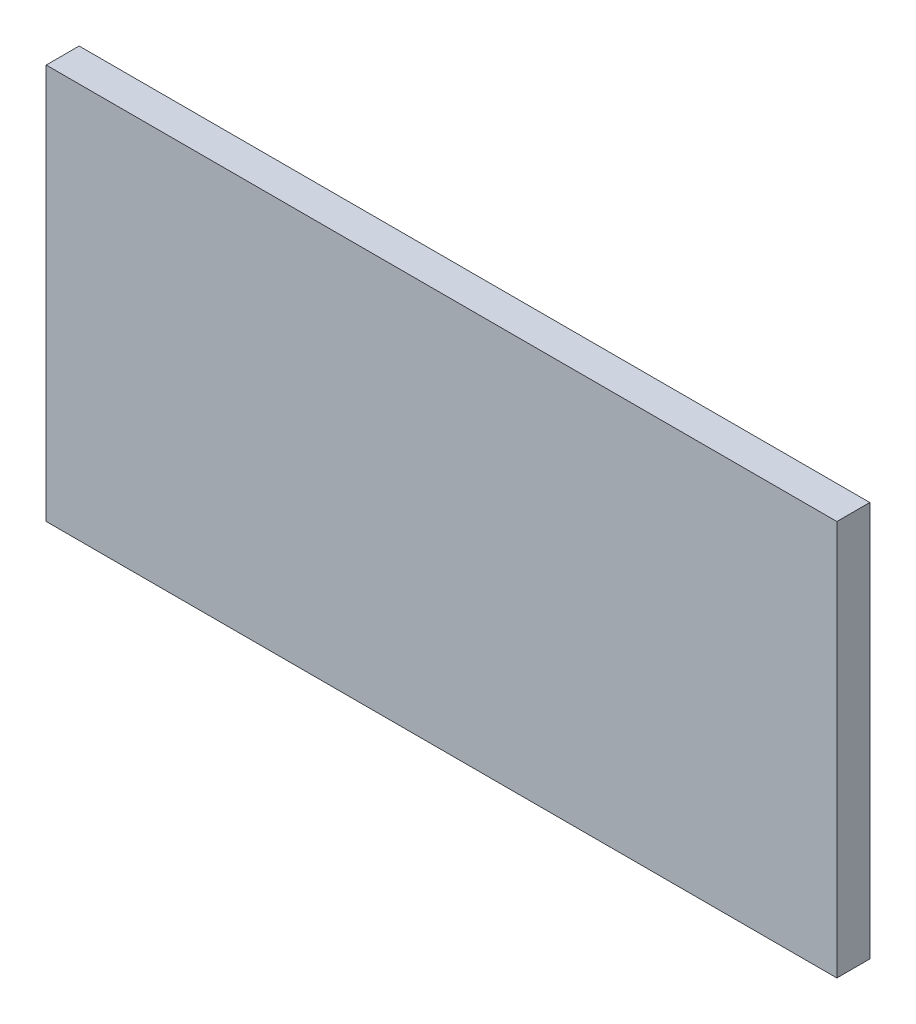
ISO-10303-21;
HEADER;
FILE_DESCRIPTION(('STEP AP214'),'2;1');
FILE_NAME('part.step','',(''),(''),'','','');
FILE_SCHEMA(('AUTOMOTIVE_DESIGN { 1 0 10303 214 1 1 1 1 }'));
ENDSEC;
DATA;
#1=APPLICATION_CONTEXT('core data for automotive mechanical design processes');
#2=APPLICATION_PROTOCOL_DEFINITION('international standard','automotive_design',2000,#1);
#3=PRODUCT_CONTEXT('',#1,'mechanical');
#4=PRODUCT('Part','Part','',(#3));
#5=PRODUCT_RELATED_PRODUCT_CATEGORY('part','',(#4));
#6=PRODUCT_DEFINITION_FORMATION('','',#4);
#7=PRODUCT_DEFINITION_CONTEXT('part definition',#1,'design');
#8=PRODUCT_DEFINITION('design','',#6,#7);
#9=PRODUCT_DEFINITION_SHAPE('','',#8);
#10=(LENGTH_UNIT() NAMED_UNIT(*) SI_UNIT(.MILLI.,.METRE.));
#11=(NAMED_UNIT(*) PLANE_ANGLE_UNIT() SI_UNIT($,.RADIAN.));
#12=(NAMED_UNIT(*) SI_UNIT($,.STERADIAN.) SOLID_ANGLE_UNIT());
#13=UNCERTAINTY_MEASURE_WITH_UNIT(LENGTH_MEASURE(1.E-05),#10,'distance_accuracy_value','');
#14=(GEOMETRIC_REPRESENTATION_CONTEXT(3) GLOBAL_UNCERTAINTY_ASSIGNED_CONTEXT((#13)) GLOBAL_UNIT_ASSIGNED_CONTEXT((#10,
#11,#12)) REPRESENTATION_CONTEXT('',''));
#15=CARTESIAN_POINT('',(0.,0.,0.));
#16=DIRECTION('',(0.,0.,1.));
#17=DIRECTION('',(1.,0.,0.));
#18=AXIS2_PLACEMENT_3D('',#15,#16,#17);
#19=CARTESIAN_POINT('',(0.,0.,12.7));
#20=DIRECTION('',(1.,0.,0.));
#21=DIRECTION('',(0.,1.,0.));
#22=AXIS2_PLACEMENT_3D('',#19,#20,#21);
#23=PLANE('',#22);
#24=DIRECTION('',(0.,-1.,0.));
#25=VECTOR('',#24,1.);
#26=CARTESIAN_POINT('',(0.,0.,0.));
#27=LINE('',#26,#25);
#28=CARTESIAN_POINT('',(0.,0.,0.));
#29=VERTEX_POINT('',#28);
#30=CARTESIAN_POINT('',(0.,-152.4,0.));
#31=VERTEX_POINT('',#30);
#32=EDGE_CURVE('E80',#29,#31,#27,.T.);
#33=ORIENTED_EDGE('',*,*,#32,.T.);
#34=DIRECTION('',(0.,0.,-1.));
#35=VECTOR('',#34,1.);
#36=CARTESIAN_POINT('',(0.,-152.4,12.7));
#37=LINE('',#36,#35);
#38=CARTESIAN_POINT('',(0.,-152.4,12.7));
#39=VERTEX_POINT('',#38);
#40=EDGE_CURVE('E11',#39,#31,#37,.T.);
#41=ORIENTED_EDGE('',*,*,#40,.F.);
#42=DIRECTION('',(0.,-1.,0.));
#43=VECTOR('',#42,1.);
#44=CARTESIAN_POINT('',(0.,0.,12.7));
#45=LINE('',#44,#43);
#46=CARTESIAN_POINT('',(0.,0.,12.7));
#47=VERTEX_POINT('',#46);
#48=EDGE_CURVE('E68',#47,#39,#45,.T.);
#49=ORIENTED_EDGE('',*,*,#48,.F.);
#50=DIRECTION('',(0.,0.,-1.));
#51=VECTOR('',#50,1.);
#52=CARTESIAN_POINT('',(0.,0.,12.7));
#53=LINE('',#52,#51);
#54=EDGE_CURVE('E76',#47,#29,#53,.T.);
#55=ORIENTED_EDGE('',*,*,#54,.T.);
#56=EDGE_LOOP('',(#33,#41,#49,#55));
#57=FACE_BOUND('',#56,.T.);
#58=ADVANCED_FACE('F17',(#57),#23,.F.);
#59=CARTESIAN_POINT('',(0.,-152.4,12.7));
#60=DIRECTION('',(0.,1.,0.));
#61=DIRECTION('',(0.,0.,1.));
#62=AXIS2_PLACEMENT_3D('',#59,#60,#61);
#63=PLANE('',#62);
#64=DIRECTION('',(1.,0.,0.));
#65=VECTOR('',#64,1.);
#66=CARTESIAN_POINT('',(0.,-152.4,0.));
#67=LINE('',#66,#65);
#68=CARTESIAN_POINT('',(304.8,-152.4,0.));
#69=VERTEX_POINT('',#68);
#70=EDGE_CURVE('E72',#31,#69,#67,.T.);
#71=ORIENTED_EDGE('',*,*,#70,.T.);
#72=DIRECTION('',(0.,0.,-1.));
#73=VECTOR('',#72,1.);
#74=CARTESIAN_POINT('',(304.8,-152.4,12.7));
#75=LINE('',#74,#73);
#76=CARTESIAN_POINT('',(304.8,-152.4,12.7));
#77=VERTEX_POINT('',#76);
#78=EDGE_CURVE('E25',#77,#69,#75,.T.);
#79=ORIENTED_EDGE('',*,*,#78,.F.);
#80=DIRECTION('',(1.,0.,0.));
#81=VECTOR('',#80,1.);
#82=CARTESIAN_POINT('',(0.,-152.4,12.7));
#83=LINE('',#82,#81);
#84=EDGE_CURVE('E63',#39,#77,#83,.T.);
#85=ORIENTED_EDGE('',*,*,#84,.F.);
#86=ORIENTED_EDGE('',*,*,#40,.T.);
#87=EDGE_LOOP('',(#71,#79,#85,#86));
#88=FACE_BOUND('',#87,.T.);
#89=ADVANCED_FACE('F71',(#88),#63,.F.);
#90=CARTESIAN_POINT('',(304.8,0.,12.7));
#91=DIRECTION('',(-1.,0.,0.));
#92=DIRECTION('',(0.,-1.,0.));
#93=AXIS2_PLACEMENT_3D('',#90,#91,#92);
#94=PLANE('',#93);
#95=DIRECTION('',(0.,1.,0.));
#96=VECTOR('',#95,1.);
#97=CARTESIAN_POINT('',(304.8,0.,0.));
#98=LINE('',#97,#96);
#99=CARTESIAN_POINT('',(304.8,0.,0.));
#100=VERTEX_POINT('',#99);
#101=EDGE_CURVE('E50',#69,#100,#98,.T.);
#102=ORIENTED_EDGE('',*,*,#101,.T.);
#103=DIRECTION('',(0.,0.,-1.));
#104=VECTOR('',#103,1.);
#105=CARTESIAN_POINT('',(304.8,0.,12.7));
#106=LINE('',#105,#104);
#107=CARTESIAN_POINT('',(304.8,0.,12.7));
#108=VERTEX_POINT('',#107);
#109=EDGE_CURVE('E73',#108,#100,#106,.T.);
#110=ORIENTED_EDGE('',*,*,#109,.F.);
#111=DIRECTION('',(0.,1.,0.));
#112=VECTOR('',#111,1.);
#113=CARTESIAN_POINT('',(304.8,0.,12.7));
#114=LINE('',#113,#112);
#115=EDGE_CURVE('E66',#77,#108,#114,.T.);
#116=ORIENTED_EDGE('',*,*,#115,.F.);
#117=ORIENTED_EDGE('',*,*,#78,.T.);
#118=EDGE_LOOP('',(#102,#110,#116,#117));
#119=FACE_BOUND('',#118,.T.);
#120=ADVANCED_FACE('F74',(#119),#94,.F.);
#121=CARTESIAN_POINT('',(0.,0.,12.7));
#122=DIRECTION('',(0.,-1.,0.));
#123=DIRECTION('',(0.,0.,-1.));
#124=AXIS2_PLACEMENT_3D('',#121,#122,#123);
#125=PLANE('',#124);
#126=DIRECTION('',(-1.,0.,0.));
#127=VECTOR('',#126,1.);
#128=CARTESIAN_POINT('',(0.,0.,0.));
#129=LINE('',#128,#127);
#130=EDGE_CURVE('E56',#100,#29,#129,.T.);
#131=ORIENTED_EDGE('',*,*,#130,.T.);
#132=ORIENTED_EDGE('',*,*,#54,.F.);
#133=DIRECTION('',(-1.,0.,0.));
#134=VECTOR('',#133,1.);
#135=CARTESIAN_POINT('',(0.,0.,12.7));
#136=LINE('',#135,#134);
#137=EDGE_CURVE('E33',#108,#47,#136,.T.);
#138=ORIENTED_EDGE('',*,*,#137,.F.);
#139=ORIENTED_EDGE('',*,*,#109,.T.);
#140=EDGE_LOOP('',(#131,#132,#138,#139));
#141=FACE_BOUND('',#140,.T.);
#142=ADVANCED_FACE('F87',(#141),#125,.F.);
#143=CARTESIAN_POINT('',(0.,-152.4,12.7));
#144=DIRECTION('',(0.,0.,1.));
#145=DIRECTION('',(1.,0.,0.));
#146=AXIS2_PLACEMENT_3D('',#143,#144,#145);
#147=PLANE('',#146);
#148=ORIENTED_EDGE('',*,*,#48,.T.);
#149=ORIENTED_EDGE('',*,*,#84,.T.);
#150=ORIENTED_EDGE('',*,*,#115,.T.);
#151=ORIENTED_EDGE('',*,*,#137,.T.);
#152=EDGE_LOOP('',(#148,#149,#150,#151));
#153=FACE_BOUND('',#152,.T.);
#154=ADVANCED_FACE('F64',(#153),#147,.T.);
#155=CARTESIAN_POINT('',(0.,-152.4,0.));
#156=DIRECTION('',(0.,0.,1.));
#157=DIRECTION('',(1.,0.,0.));
#158=AXIS2_PLACEMENT_3D('',#155,#156,#157);
#159=PLANE('',#158);
#160=ORIENTED_EDGE('',*,*,#32,.F.);
#161=ORIENTED_EDGE('',*,*,#130,.F.);
#162=ORIENTED_EDGE('',*,*,#101,.F.);
#163=ORIENTED_EDGE('',*,*,#70,.F.);
#164=EDGE_LOOP('',(#160,#161,#162,#163));
#165=FACE_BOUND('',#164,.T.);
#166=ADVANCED_FACE('F90',(#165),#159,.F.);
#167=CLOSED_SHELL('',(#58,#89,#120,#142,#154,#166));
#168=MANIFOLD_SOLID_BREP('B1',#167);
#169=ADVANCED_BREP_SHAPE_REPRESENTATION('',(#18,#168),#14);
#170=SHAPE_DEFINITION_REPRESENTATION(#9,#169);
ENDSEC;
END-ISO-10303-21;
